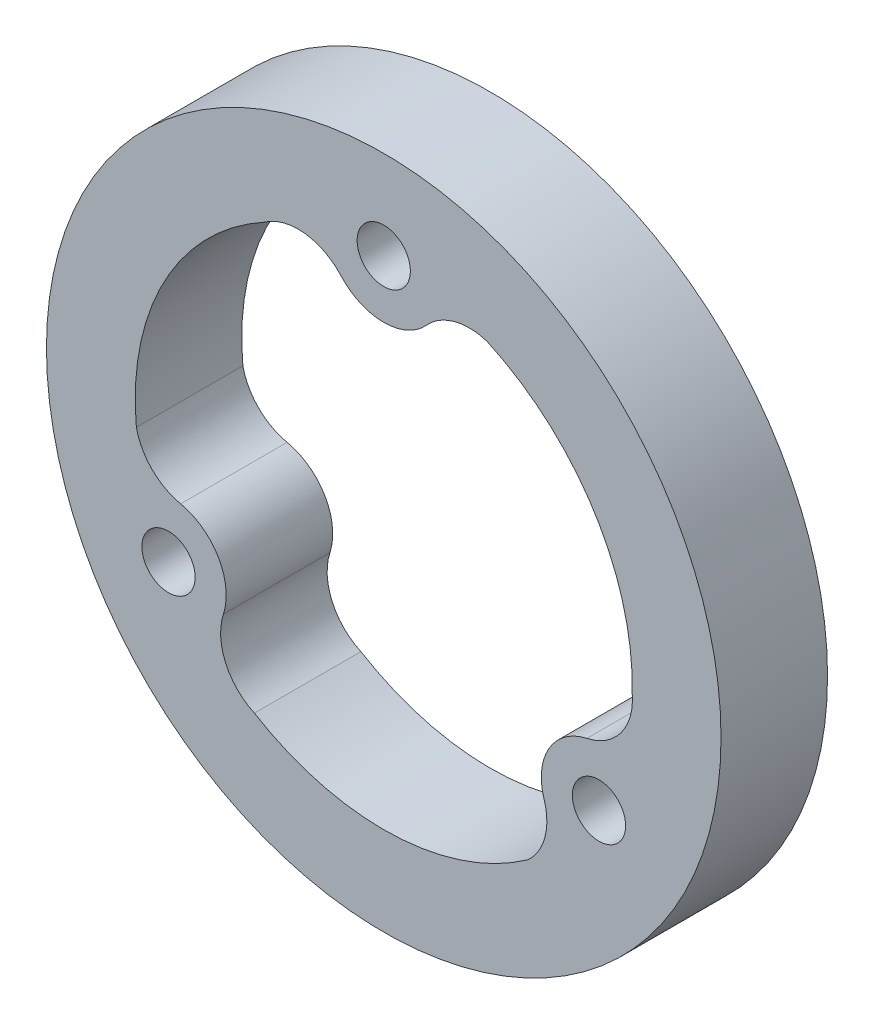
ISO-10303-21;
HEADER;
FILE_DESCRIPTION(('STEP AP214'),'2;1');
FILE_NAME('part.step','',(''),(''),'','','');
FILE_SCHEMA(('AUTOMOTIVE_DESIGN { 1 0 10303 214 1 1 1 1 }'));
ENDSEC;
DATA;
#1=APPLICATION_CONTEXT('core data for automotive mechanical design processes');
#2=APPLICATION_PROTOCOL_DEFINITION('international standard','automotive_design',2000,#1);
#3=PRODUCT_CONTEXT('',#1,'mechanical');
#4=PRODUCT('Part','Part','',(#3));
#5=PRODUCT_RELATED_PRODUCT_CATEGORY('part','',(#4));
#6=PRODUCT_DEFINITION_FORMATION('','',#4);
#7=PRODUCT_DEFINITION_CONTEXT('part definition',#1,'design');
#8=PRODUCT_DEFINITION('design','',#6,#7);
#9=PRODUCT_DEFINITION_SHAPE('','',#8);
#10=(LENGTH_UNIT() NAMED_UNIT(*) SI_UNIT(.MILLI.,.METRE.));
#11=(NAMED_UNIT(*) PLANE_ANGLE_UNIT() SI_UNIT($,.RADIAN.));
#12=(NAMED_UNIT(*) SI_UNIT($,.STERADIAN.) SOLID_ANGLE_UNIT());
#13=UNCERTAINTY_MEASURE_WITH_UNIT(LENGTH_MEASURE(1.E-05),#10,'distance_accuracy_value','');
#14=(GEOMETRIC_REPRESENTATION_CONTEXT(3) GLOBAL_UNCERTAINTY_ASSIGNED_CONTEXT((#13)) GLOBAL_UNIT_ASSIGNED_CONTEXT((#10,
#11,#12)) REPRESENTATION_CONTEXT('',''));
#15=CARTESIAN_POINT('',(0.,0.,0.));
#16=DIRECTION('',(0.,0.,1.));
#17=DIRECTION('',(1.,0.,0.));
#18=AXIS2_PLACEMENT_3D('',#15,#16,#17);
#19=CARTESIAN_POINT('',(0.,0.,6.));
#20=DIRECTION('',(0.,0.,1.));
#21=DIRECTION('',(1.,0.,0.));
#22=AXIS2_PLACEMENT_3D('',#19,#20,#21);
#23=PLANE('',#22);
#24=CARTESIAN_POINT('',(0.,0.,6.));
#25=DIRECTION('',(0.,0.,1.));
#26=DIRECTION('',(1.,0.,0.));
#27=AXIS2_PLACEMENT_3D('',#24,#25,#26);
#28=CIRCLE('',#27,14.);
#29=CARTESIAN_POINT('',(13.9959775932849,-0.335575935174573,6.));
#30=VERTEX_POINT('',#29);
#31=CARTESIAN_POINT('',(5.80943087987062,12.7377593340432,6.));
#32=VERTEX_POINT('',#31);
#33=EDGE_CURVE('E130',#30,#32,#28,.T.);
#34=ORIENTED_EDGE('',*,*,#33,.F.);
#35=CARTESIAN_POINT('',(10.7607074751454,-0.644650784804921,6.));
#36=DIRECTION('',(0.,0.,1.));
#37=DIRECTION('',(1.,0.,0.));
#38=AXIS2_PLACEMENT_3D('',#35,#36,#37);
#39=CIRCLE('',#38,3.25);
#40=CARTESIAN_POINT('',(11.4425315640637,-3.82232539240255,6.));
#41=VERTEX_POINT('',#40);
#42=EDGE_CURVE('E122',#41,#30,#39,.T.);
#43=ORIENTED_EDGE('',*,*,#42,.F.);
#44=CARTESIAN_POINT('',(12.124355652982,-7.00000000000017,6.));
#45=DIRECTION('',(0.,0.,-1.));
#46=DIRECTION('',(1.,0.,0.));
#47=AXIS2_PLACEMENT_3D('',#44,#45,#46);
#48=CIRCLE('',#47,3.25);
#49=CARTESIAN_POINT('',(9.03149667338257,-7.99836032188346,6.));
#50=VERTEX_POINT('',#49);
#51=EDGE_CURVE('E165',#50,#41,#48,.T.);
#52=ORIENTED_EDGE('',*,*,#51,.F.);
#53=CARTESIAN_POINT('',(5.93863769378309,-8.99672064376674,6.));
#54=DIRECTION('',(0.,0.,1.));
#55=DIRECTION('',(1.,0.,0.));
#56=AXIS2_PLACEMENT_3D('',#53,#54,#55);
#57=CIRCLE('',#56,3.25);
#58=CARTESIAN_POINT('',(8.12650773063849,-11.3999943905194,6.));
#59=VERTEX_POINT('',#58);
#60=EDGE_CURVE('E163',#59,#50,#57,.T.);
#61=ORIENTED_EDGE('',*,*,#60,.F.);
#62=CARTESIAN_POINT('',(0.,0.,6.));
#63=DIRECTION('',(0.,0.,1.));
#64=DIRECTION('',(1.,0.,0.));
#65=AXIS2_PLACEMENT_3D('',#62,#63,#64);
#66=CIRCLE('',#65,14.);
#67=CARTESIAN_POINT('',(-7.28860608140232,-11.9530841789952,6.));
#68=VERTEX_POINT('',#67);
#69=EDGE_CURVE('E161',#68,#59,#66,.T.);
#70=ORIENTED_EDGE('',*,*,#69,.F.);
#71=CARTESIAN_POINT('',(-5.93863769378334,-8.99672064376658,6.));
#72=DIRECTION('',(0.,0.,1.));
#73=DIRECTION('',(1.,0.,0.));
#74=AXIS2_PLACEMENT_3D('',#71,#72,#73);
#75=CIRCLE('',#74,3.25);
#76=CARTESIAN_POINT('',(-9.03149667338279,-7.9983603218832,6.));
#77=VERTEX_POINT('',#76);
#78=EDGE_CURVE('E159',#77,#68,#75,.T.);
#79=ORIENTED_EDGE('',*,*,#78,.F.);
#80=CARTESIAN_POINT('',(-12.1243556529822,-6.99999999999983,6.));
#81=DIRECTION('',(0.,0.,-1.));
#82=DIRECTION('',(1.,0.,0.));
#83=AXIS2_PLACEMENT_3D('',#80,#81,#82);
#84=CIRCLE('',#83,3.25);
#85=CARTESIAN_POINT('',(-11.4425315640638,-3.82232539240223,6.));
#86=VERTEX_POINT('',#85);
#87=EDGE_CURVE('E157',#86,#77,#84,.T.);
#88=ORIENTED_EDGE('',*,*,#87,.F.);
#89=CARTESIAN_POINT('',(-10.7607074751454,-0.644650784804622,6.));
#90=DIRECTION('',(0.,0.,1.));
#91=DIRECTION('',(1.,0.,0.));
#92=AXIS2_PLACEMENT_3D('',#89,#90,#91);
#93=CIRCLE('',#92,3.25);
#94=CARTESIAN_POINT('',(-13.9359386105091,-1.33776494352389,6.));
#95=VERTEX_POINT('',#94);
#96=EDGE_CURVE('E155',#95,#86,#93,.T.);
#97=ORIENTED_EDGE('',*,*,#96,.F.);
#98=CARTESIAN_POINT('',(0.,0.,6.));
#99=DIRECTION('',(0.,0.,1.));
#100=DIRECTION('',(1.,0.,0.));
#101=AXIS2_PLACEMENT_3D('',#98,#99,#100);
#102=CIRCLE('',#101,14.);
#103=CARTESIAN_POINT('',(-6.70737151188253,12.2886601141698,6.));
#104=VERTEX_POINT('',#103);
#105=EDGE_CURVE('E153',#104,#95,#102,.T.);
#106=ORIENTED_EDGE('',*,*,#105,.F.);
#107=CARTESIAN_POINT('',(-4.82206978136206,9.6413714285715,6.));
#108=DIRECTION('',(0.,0.,1.));
#109=DIRECTION('',(1.,0.,0.));
#110=AXIS2_PLACEMENT_3D('',#107,#108,#109);
#111=CIRCLE('',#110,3.25);
#112=CARTESIAN_POINT('',(-2.41103489068093,11.8206857142857,6.));
#113=VERTEX_POINT('',#112);
#114=EDGE_CURVE('E151',#113,#104,#111,.T.);
#115=ORIENTED_EDGE('',*,*,#114,.F.);
#116=CARTESIAN_POINT('',(2.01540808952837E-13,14.,6.));
#117=DIRECTION('',(0.,0.,-1.));
#118=DIRECTION('',(1.,0.,0.));
#119=AXIS2_PLACEMENT_3D('',#116,#117,#118);
#120=CIRCLE('',#119,3.25);
#121=CARTESIAN_POINT('',(2.41103489068127,11.8206857142857,6.));
#122=VERTEX_POINT('',#121);
#123=EDGE_CURVE('E146',#122,#113,#120,.T.);
#124=ORIENTED_EDGE('',*,*,#123,.F.);
#125=CARTESIAN_POINT('',(4.82206978136234,9.64137142857136,6.));
#126=DIRECTION('',(0.,0.,1.));
#127=DIRECTION('',(1.,0.,0.));
#128=AXIS2_PLACEMENT_3D('',#125,#126,#127);
#129=CIRCLE('',#128,3.25);
#130=EDGE_CURVE('E144',#32,#122,#129,.T.);
#131=ORIENTED_EDGE('',*,*,#130,.F.);
#132=EDGE_LOOP('',(#34,#43,#52,#61,#70,#79,#88,#97,#106,#115,#124,#131));
#133=FACE_BOUND('',#132,.T.);
#134=CARTESIAN_POINT('',(12.124355652982,-7.00000000000017,6.));
#135=DIRECTION('',(0.,0.,1.));
#136=DIRECTION('',(1.,0.,0.));
#137=AXIS2_PLACEMENT_3D('',#134,#135,#136);
#138=CIRCLE('',#137,1.50000000000007);
#139=CARTESIAN_POINT('',(13.6243556529821,-7.00000000000017,6.));
#140=VERTEX_POINT('',#139);
#141=EDGE_CURVE('E218',#140,#140,#138,.T.);
#142=ORIENTED_EDGE('',*,*,#141,.F.);
#143=EDGE_LOOP('',(#142));
#144=FACE_BOUND('',#143,.T.);
#145=CARTESIAN_POINT('',(0.,0.,6.));
#146=DIRECTION('',(0.,0.,1.));
#147=DIRECTION('',(1.,0.,0.));
#148=AXIS2_PLACEMENT_3D('',#145,#146,#147);
#149=CIRCLE('',#148,19.);
#150=CARTESIAN_POINT('',(19.,0.,6.));
#151=VERTEX_POINT('',#150);
#152=EDGE_CURVE('E11',#151,#151,#149,.T.);
#153=ORIENTED_EDGE('',*,*,#152,.T.);
#154=EDGE_LOOP('',(#153));
#155=FACE_BOUND('',#154,.T.);
#156=CARTESIAN_POINT('',(2.01540808952837E-13,14.,6.));
#157=DIRECTION('',(0.,0.,1.));
#158=DIRECTION('',(1.,0.,0.));
#159=AXIS2_PLACEMENT_3D('',#156,#157,#158);
#160=CIRCLE('',#159,1.5);
#161=CARTESIAN_POINT('',(1.5000000000002,14.,6.));
#162=VERTEX_POINT('',#161);
#163=EDGE_CURVE('E224',#162,#162,#160,.T.);
#164=ORIENTED_EDGE('',*,*,#163,.F.);
#165=EDGE_LOOP('',(#164));
#166=FACE_BOUND('',#165,.T.);
#167=CARTESIAN_POINT('',(-12.1243556529822,-6.99999999999983,6.));
#168=DIRECTION('',(0.,0.,1.));
#169=DIRECTION('',(1.,0.,0.));
#170=AXIS2_PLACEMENT_3D('',#167,#168,#169);
#171=CIRCLE('',#170,1.5);
#172=CARTESIAN_POINT('',(-10.6243556529822,-6.99999999999983,6.));
#173=VERTEX_POINT('',#172);
#174=EDGE_CURVE('E168',#173,#173,#171,.T.);
#175=ORIENTED_EDGE('',*,*,#174,.F.);
#176=EDGE_LOOP('',(#175));
#177=FACE_BOUND('',#176,.T.);
#178=ADVANCED_FACE('F33',(#133,#144,#155,#166,#177),#23,.T.);
#179=CARTESIAN_POINT('',(0.,0.,0.));
#180=DIRECTION('',(0.,0.,1.));
#181=DIRECTION('',(1.,0.,0.));
#182=AXIS2_PLACEMENT_3D('',#179,#180,#181);
#183=PLANE('',#182);
#184=CARTESIAN_POINT('',(12.124355652982,-7.00000000000017,0.));
#185=DIRECTION('',(0.,0.,1.));
#186=DIRECTION('',(1.,0.,0.));
#187=AXIS2_PLACEMENT_3D('',#184,#185,#186);
#188=CIRCLE('',#187,1.50000000000007);
#189=CARTESIAN_POINT('',(13.6243556529821,-7.00000000000017,0.));
#190=VERTEX_POINT('',#189);
#191=EDGE_CURVE('E138',#190,#190,#188,.T.);
#192=ORIENTED_EDGE('',*,*,#191,.T.);
#193=EDGE_LOOP('',(#192));
#194=FACE_BOUND('',#193,.T.);
#195=CARTESIAN_POINT('',(2.01540808952837E-13,14.,0.));
#196=DIRECTION('',(0.,0.,1.));
#197=DIRECTION('',(1.,0.,0.));
#198=AXIS2_PLACEMENT_3D('',#195,#196,#197);
#199=CIRCLE('',#198,1.5);
#200=CARTESIAN_POINT('',(1.5000000000002,14.,0.));
#201=VERTEX_POINT('',#200);
#202=EDGE_CURVE('E221',#201,#201,#199,.T.);
#203=ORIENTED_EDGE('',*,*,#202,.T.);
#204=EDGE_LOOP('',(#203));
#205=FACE_BOUND('',#204,.T.);
#206=CARTESIAN_POINT('',(0.,0.,0.));
#207=DIRECTION('',(0.,0.,1.));
#208=DIRECTION('',(1.,0.,0.));
#209=AXIS2_PLACEMENT_3D('',#206,#207,#208);
#210=CIRCLE('',#209,19.);
#211=CARTESIAN_POINT('',(19.,0.,0.));
#212=VERTEX_POINT('',#211);
#213=EDGE_CURVE('E37',#212,#212,#210,.T.);
#214=ORIENTED_EDGE('',*,*,#213,.F.);
#215=EDGE_LOOP('',(#214));
#216=FACE_BOUND('',#215,.T.);
#217=CARTESIAN_POINT('',(10.7607074751454,-0.644650784804921,0.));
#218=DIRECTION('',(0.,0.,1.));
#219=DIRECTION('',(1.,0.,0.));
#220=AXIS2_PLACEMENT_3D('',#217,#218,#219);
#221=CIRCLE('',#220,3.25);
#222=CARTESIAN_POINT('',(11.4425315640637,-3.82232539240255,0.));
#223=VERTEX_POINT('',#222);
#224=CARTESIAN_POINT('',(13.9959775932849,-0.335575935174573,0.));
#225=VERTEX_POINT('',#224);
#226=EDGE_CURVE('E56',#223,#225,#221,.T.);
#227=ORIENTED_EDGE('',*,*,#226,.T.);
#228=CARTESIAN_POINT('',(0.,0.,0.));
#229=DIRECTION('',(0.,0.,1.));
#230=DIRECTION('',(1.,0.,0.));
#231=AXIS2_PLACEMENT_3D('',#228,#229,#230);
#232=CIRCLE('',#231,14.);
#233=CARTESIAN_POINT('',(5.80943087987062,12.7377593340432,0.));
#234=VERTEX_POINT('',#233);
#235=EDGE_CURVE('E137',#225,#234,#232,.T.);
#236=ORIENTED_EDGE('',*,*,#235,.T.);
#237=CARTESIAN_POINT('',(4.82206978136234,9.64137142857136,0.));
#238=DIRECTION('',(0.,0.,1.));
#239=DIRECTION('',(1.,0.,0.));
#240=AXIS2_PLACEMENT_3D('',#237,#238,#239);
#241=CIRCLE('',#240,3.25);
#242=CARTESIAN_POINT('',(2.41103489068127,11.8206857142857,0.));
#243=VERTEX_POINT('',#242);
#244=EDGE_CURVE('E170',#234,#243,#241,.T.);
#245=ORIENTED_EDGE('',*,*,#244,.T.);
#246=CARTESIAN_POINT('',(2.01540808952837E-13,14.,0.));
#247=DIRECTION('',(0.,0.,-1.));
#248=DIRECTION('',(1.,0.,0.));
#249=AXIS2_PLACEMENT_3D('',#246,#247,#248);
#250=CIRCLE('',#249,3.25);
#251=CARTESIAN_POINT('',(-2.41103489068093,11.8206857142857,0.));
#252=VERTEX_POINT('',#251);
#253=EDGE_CURVE('E173',#243,#252,#250,.T.);
#254=ORIENTED_EDGE('',*,*,#253,.T.);
#255=CARTESIAN_POINT('',(-4.82206978136206,9.6413714285715,0.));
#256=DIRECTION('',(0.,0.,1.));
#257=DIRECTION('',(1.,0.,0.));
#258=AXIS2_PLACEMENT_3D('',#255,#256,#257);
#259=CIRCLE('',#258,3.25);
#260=CARTESIAN_POINT('',(-6.70737151188253,12.2886601141698,0.));
#261=VERTEX_POINT('',#260);
#262=EDGE_CURVE('E176',#252,#261,#259,.T.);
#263=ORIENTED_EDGE('',*,*,#262,.T.);
#264=CARTESIAN_POINT('',(0.,0.,0.));
#265=DIRECTION('',(0.,0.,1.));
#266=DIRECTION('',(1.,0.,0.));
#267=AXIS2_PLACEMENT_3D('',#264,#265,#266);
#268=CIRCLE('',#267,14.);
#269=CARTESIAN_POINT('',(-13.9359386105091,-1.33776494352389,0.));
#270=VERTEX_POINT('',#269);
#271=EDGE_CURVE('E179',#261,#270,#268,.T.);
#272=ORIENTED_EDGE('',*,*,#271,.T.);
#273=CARTESIAN_POINT('',(-10.7607074751454,-0.644650784804622,0.));
#274=DIRECTION('',(0.,0.,1.));
#275=DIRECTION('',(1.,0.,0.));
#276=AXIS2_PLACEMENT_3D('',#273,#274,#275);
#277=CIRCLE('',#276,3.25);
#278=CARTESIAN_POINT('',(-11.4425315640638,-3.82232539240223,0.));
#279=VERTEX_POINT('',#278);
#280=EDGE_CURVE('E182',#270,#279,#277,.T.);
#281=ORIENTED_EDGE('',*,*,#280,.T.);
#282=CARTESIAN_POINT('',(-12.1243556529822,-6.99999999999983,0.));
#283=DIRECTION('',(0.,0.,-1.));
#284=DIRECTION('',(1.,0.,0.));
#285=AXIS2_PLACEMENT_3D('',#282,#283,#284);
#286=CIRCLE('',#285,3.25);
#287=CARTESIAN_POINT('',(-9.03149667338279,-7.9983603218832,0.));
#288=VERTEX_POINT('',#287);
#289=EDGE_CURVE('E185',#279,#288,#286,.T.);
#290=ORIENTED_EDGE('',*,*,#289,.T.);
#291=CARTESIAN_POINT('',(-5.93863769378334,-8.99672064376658,0.));
#292=DIRECTION('',(0.,0.,1.));
#293=DIRECTION('',(1.,0.,0.));
#294=AXIS2_PLACEMENT_3D('',#291,#292,#293);
#295=CIRCLE('',#294,3.25);
#296=CARTESIAN_POINT('',(-7.28860608140232,-11.9530841789952,0.));
#297=VERTEX_POINT('',#296);
#298=EDGE_CURVE('E188',#288,#297,#295,.T.);
#299=ORIENTED_EDGE('',*,*,#298,.T.);
#300=CARTESIAN_POINT('',(0.,0.,0.));
#301=DIRECTION('',(0.,0.,1.));
#302=DIRECTION('',(1.,0.,0.));
#303=AXIS2_PLACEMENT_3D('',#300,#301,#302);
#304=CIRCLE('',#303,14.);
#305=CARTESIAN_POINT('',(8.12650773063849,-11.3999943905194,0.));
#306=VERTEX_POINT('',#305);
#307=EDGE_CURVE('E191',#297,#306,#304,.T.);
#308=ORIENTED_EDGE('',*,*,#307,.T.);
#309=CARTESIAN_POINT('',(5.93863769378309,-8.99672064376674,0.));
#310=DIRECTION('',(0.,0.,1.));
#311=DIRECTION('',(1.,0.,0.));
#312=AXIS2_PLACEMENT_3D('',#309,#310,#311);
#313=CIRCLE('',#312,3.25);
#314=CARTESIAN_POINT('',(9.03149667338257,-7.99836032188346,0.));
#315=VERTEX_POINT('',#314);
#316=EDGE_CURVE('E194',#306,#315,#313,.T.);
#317=ORIENTED_EDGE('',*,*,#316,.T.);
#318=CARTESIAN_POINT('',(12.124355652982,-7.00000000000017,0.));
#319=DIRECTION('',(0.,0.,-1.));
#320=DIRECTION('',(1.,0.,0.));
#321=AXIS2_PLACEMENT_3D('',#318,#319,#320);
#322=CIRCLE('',#321,3.25);
#323=EDGE_CURVE('E131',#315,#223,#322,.T.);
#324=ORIENTED_EDGE('',*,*,#323,.T.);
#325=EDGE_LOOP('',(#227,#236,#245,#254,#263,#272,#281,#290,#299,#308,#317,#324));
#326=FACE_BOUND('',#325,.T.);
#327=CARTESIAN_POINT('',(-12.1243556529822,-6.99999999999983,0.));
#328=DIRECTION('',(0.,0.,1.));
#329=DIRECTION('',(1.,0.,0.));
#330=AXIS2_PLACEMENT_3D('',#327,#328,#329);
#331=CIRCLE('',#330,1.5);
#332=CARTESIAN_POINT('',(-10.6243556529822,-6.99999999999983,0.));
#333=VERTEX_POINT('',#332);
#334=EDGE_CURVE('E403',#333,#333,#331,.T.);
#335=ORIENTED_EDGE('',*,*,#334,.T.);
#336=EDGE_LOOP('',(#335));
#337=FACE_BOUND('',#336,.T.);
#338=ADVANCED_FACE('F230',(#194,#205,#216,#326,#337),#183,.F.);
#339=CARTESIAN_POINT('',(0.,0.,6.));
#340=DIRECTION('',(0.,0.,-1.));
#341=DIRECTION('',(-1.,0.,0.));
#342=AXIS2_PLACEMENT_3D('',#339,#340,#341);
#343=CYLINDRICAL_SURFACE('',#342,19.);
#344=ORIENTED_EDGE('',*,*,#152,.F.);
#345=EDGE_LOOP('',(#344));
#346=FACE_BOUND('',#345,.T.);
#347=ORIENTED_EDGE('',*,*,#213,.T.);
#348=EDGE_LOOP('',(#347));
#349=FACE_BOUND('',#348,.T.);
#350=ADVANCED_FACE('F35',(#346,#349),#343,.T.);
#351=CARTESIAN_POINT('',(2.01540808952837E-13,14.,6.));
#352=DIRECTION('',(0.,0.,-1.));
#353=DIRECTION('',(-1.,0.,0.));
#354=AXIS2_PLACEMENT_3D('',#351,#352,#353);
#355=CYLINDRICAL_SURFACE('',#354,1.5);
#356=ORIENTED_EDGE('',*,*,#163,.T.);
#357=EDGE_LOOP('',(#356));
#358=FACE_BOUND('',#357,.T.);
#359=ORIENTED_EDGE('',*,*,#202,.F.);
#360=EDGE_LOOP('',(#359));
#361=FACE_BOUND('',#360,.T.);
#362=ADVANCED_FACE('F233',(#358,#361),#355,.F.);
#363=CARTESIAN_POINT('',(12.124355652982,-7.00000000000017,6.));
#364=DIRECTION('',(0.,0.,-1.));
#365=DIRECTION('',(-1.,0.,0.));
#366=AXIS2_PLACEMENT_3D('',#363,#364,#365);
#367=CYLINDRICAL_SURFACE('',#366,1.50000000000007);
#368=ORIENTED_EDGE('',*,*,#141,.T.);
#369=EDGE_LOOP('',(#368));
#370=FACE_BOUND('',#369,.T.);
#371=ORIENTED_EDGE('',*,*,#191,.F.);
#372=EDGE_LOOP('',(#371));
#373=FACE_BOUND('',#372,.T.);
#374=ADVANCED_FACE('F235',(#370,#373),#367,.F.);
#375=CARTESIAN_POINT('',(10.7607074751454,-0.644650784804921,6.));
#376=DIRECTION('',(0.,0.,-1.));
#377=DIRECTION('',(-1.,0.,0.));
#378=AXIS2_PLACEMENT_3D('',#375,#376,#377);
#379=CYLINDRICAL_SURFACE('',#378,3.25);
#380=ORIENTED_EDGE('',*,*,#226,.F.);
#381=DIRECTION('',(0.,0.,-1.));
#382=VECTOR('',#381,1.);
#383=CARTESIAN_POINT('',(11.4425315640637,-3.82232539240255,6.));
#384=LINE('',#383,#382);
#385=EDGE_CURVE('E126',#41,#223,#384,.T.);
#386=ORIENTED_EDGE('',*,*,#385,.F.);
#387=ORIENTED_EDGE('',*,*,#42,.T.);
#388=DIRECTION('',(0.,0.,-1.));
#389=VECTOR('',#388,1.);
#390=CARTESIAN_POINT('',(13.9959775932849,-0.335575935174573,6.));
#391=LINE('',#390,#389);
#392=EDGE_CURVE('E125',#30,#225,#391,.T.);
#393=ORIENTED_EDGE('',*,*,#392,.T.);
#394=EDGE_LOOP('',(#380,#386,#387,#393));
#395=FACE_BOUND('',#394,.T.);
#396=ADVANCED_FACE('F124',(#395),#379,.F.);
#397=CARTESIAN_POINT('',(0.,0.,6.));
#398=DIRECTION('',(0.,0.,-1.));
#399=DIRECTION('',(-1.,0.,0.));
#400=AXIS2_PLACEMENT_3D('',#397,#398,#399);
#401=CYLINDRICAL_SURFACE('',#400,14.);
#402=ORIENTED_EDGE('',*,*,#235,.F.);
#403=ORIENTED_EDGE('',*,*,#392,.F.);
#404=ORIENTED_EDGE('',*,*,#33,.T.);
#405=DIRECTION('',(0.,0.,-1.));
#406=VECTOR('',#405,1.);
#407=CARTESIAN_POINT('',(5.80943087987062,12.7377593340432,6.));
#408=LINE('',#407,#406);
#409=EDGE_CURVE('E139',#32,#234,#408,.T.);
#410=ORIENTED_EDGE('',*,*,#409,.T.);
#411=EDGE_LOOP('',(#402,#403,#404,#410));
#412=FACE_BOUND('',#411,.T.);
#413=ADVANCED_FACE('F134',(#412),#401,.F.);
#414=CARTESIAN_POINT('',(4.82206978136234,9.64137142857136,6.));
#415=DIRECTION('',(0.,0.,-1.));
#416=DIRECTION('',(-1.,0.,0.));
#417=AXIS2_PLACEMENT_3D('',#414,#415,#416);
#418=CYLINDRICAL_SURFACE('',#417,3.25);
#419=ORIENTED_EDGE('',*,*,#244,.F.);
#420=ORIENTED_EDGE('',*,*,#409,.F.);
#421=ORIENTED_EDGE('',*,*,#130,.T.);
#422=DIRECTION('',(0.,0.,-1.));
#423=VECTOR('',#422,1.);
#424=CARTESIAN_POINT('',(2.41103489068127,11.8206857142857,6.));
#425=LINE('',#424,#423);
#426=EDGE_CURVE('E215',#122,#243,#425,.T.);
#427=ORIENTED_EDGE('',*,*,#426,.T.);
#428=EDGE_LOOP('',(#419,#420,#421,#427));
#429=FACE_BOUND('',#428,.T.);
#430=ADVANCED_FACE('F286',(#429),#418,.F.);
#431=CARTESIAN_POINT('',(2.01540808952837E-13,14.,6.));
#432=DIRECTION('',(0.,0.,-1.));
#433=DIRECTION('',(-1.,0.,0.));
#434=AXIS2_PLACEMENT_3D('',#431,#432,#433);
#435=CYLINDRICAL_SURFACE('',#434,3.25);
#436=ORIENTED_EDGE('',*,*,#253,.F.);
#437=ORIENTED_EDGE('',*,*,#426,.F.);
#438=ORIENTED_EDGE('',*,*,#123,.T.);
#439=DIRECTION('',(0.,0.,-1.));
#440=VECTOR('',#439,1.);
#441=CARTESIAN_POINT('',(-2.41103489068093,11.8206857142857,6.));
#442=LINE('',#441,#440);
#443=EDGE_CURVE('E213',#113,#252,#442,.T.);
#444=ORIENTED_EDGE('',*,*,#443,.T.);
#445=EDGE_LOOP('',(#436,#437,#438,#444));
#446=FACE_BOUND('',#445,.T.);
#447=ADVANCED_FACE('F295',(#446),#435,.T.);
#448=CARTESIAN_POINT('',(-4.82206978136206,9.6413714285715,6.));
#449=DIRECTION('',(0.,0.,-1.));
#450=DIRECTION('',(-1.,0.,0.));
#451=AXIS2_PLACEMENT_3D('',#448,#449,#450);
#452=CYLINDRICAL_SURFACE('',#451,3.25);
#453=ORIENTED_EDGE('',*,*,#262,.F.);
#454=ORIENTED_EDGE('',*,*,#443,.F.);
#455=ORIENTED_EDGE('',*,*,#114,.T.);
#456=DIRECTION('',(0.,0.,-1.));
#457=VECTOR('',#456,1.);
#458=CARTESIAN_POINT('',(-6.70737151188253,12.2886601141698,6.));
#459=LINE('',#458,#457);
#460=EDGE_CURVE('E211',#104,#261,#459,.T.);
#461=ORIENTED_EDGE('',*,*,#460,.T.);
#462=EDGE_LOOP('',(#453,#454,#455,#461));
#463=FACE_BOUND('',#462,.T.);
#464=ADVANCED_FACE('F305',(#463),#452,.F.);
#465=CARTESIAN_POINT('',(0.,0.,6.));
#466=DIRECTION('',(0.,0.,-1.));
#467=DIRECTION('',(-1.,0.,0.));
#468=AXIS2_PLACEMENT_3D('',#465,#466,#467);
#469=CYLINDRICAL_SURFACE('',#468,14.);
#470=ORIENTED_EDGE('',*,*,#271,.F.);
#471=ORIENTED_EDGE('',*,*,#460,.F.);
#472=ORIENTED_EDGE('',*,*,#105,.T.);
#473=DIRECTION('',(0.,0.,-1.));
#474=VECTOR('',#473,1.);
#475=CARTESIAN_POINT('',(-13.9359386105091,-1.33776494352389,6.));
#476=LINE('',#475,#474);
#477=EDGE_CURVE('E209',#95,#270,#476,.T.);
#478=ORIENTED_EDGE('',*,*,#477,.T.);
#479=EDGE_LOOP('',(#470,#471,#472,#478));
#480=FACE_BOUND('',#479,.T.);
#481=ADVANCED_FACE('F315',(#480),#469,.F.);
#482=CARTESIAN_POINT('',(-10.7607074751454,-0.644650784804622,6.));
#483=DIRECTION('',(0.,0.,-1.));
#484=DIRECTION('',(-1.,0.,0.));
#485=AXIS2_PLACEMENT_3D('',#482,#483,#484);
#486=CYLINDRICAL_SURFACE('',#485,3.25);
#487=ORIENTED_EDGE('',*,*,#280,.F.);
#488=ORIENTED_EDGE('',*,*,#477,.F.);
#489=ORIENTED_EDGE('',*,*,#96,.T.);
#490=DIRECTION('',(0.,0.,-1.));
#491=VECTOR('',#490,1.);
#492=CARTESIAN_POINT('',(-11.4425315640638,-3.82232539240223,6.));
#493=LINE('',#492,#491);
#494=EDGE_CURVE('E207',#86,#279,#493,.T.);
#495=ORIENTED_EDGE('',*,*,#494,.T.);
#496=EDGE_LOOP('',(#487,#488,#489,#495));
#497=FACE_BOUND('',#496,.T.);
#498=ADVANCED_FACE('F325',(#497),#486,.F.);
#499=CARTESIAN_POINT('',(-12.1243556529822,-6.99999999999983,6.));
#500=DIRECTION('',(0.,0.,-1.));
#501=DIRECTION('',(-1.,0.,0.));
#502=AXIS2_PLACEMENT_3D('',#499,#500,#501);
#503=CYLINDRICAL_SURFACE('',#502,3.25);
#504=ORIENTED_EDGE('',*,*,#289,.F.);
#505=ORIENTED_EDGE('',*,*,#494,.F.);
#506=ORIENTED_EDGE('',*,*,#87,.T.);
#507=DIRECTION('',(0.,0.,-1.));
#508=VECTOR('',#507,1.);
#509=CARTESIAN_POINT('',(-9.03149667338279,-7.9983603218832,6.));
#510=LINE('',#509,#508);
#511=EDGE_CURVE('E205',#77,#288,#510,.T.);
#512=ORIENTED_EDGE('',*,*,#511,.T.);
#513=EDGE_LOOP('',(#504,#505,#506,#512));
#514=FACE_BOUND('',#513,.T.);
#515=ADVANCED_FACE('F335',(#514),#503,.T.);
#516=CARTESIAN_POINT('',(-5.93863769378334,-8.99672064376658,6.));
#517=DIRECTION('',(0.,0.,-1.));
#518=DIRECTION('',(-1.,0.,0.));
#519=AXIS2_PLACEMENT_3D('',#516,#517,#518);
#520=CYLINDRICAL_SURFACE('',#519,3.25);
#521=ORIENTED_EDGE('',*,*,#298,.F.);
#522=ORIENTED_EDGE('',*,*,#511,.F.);
#523=ORIENTED_EDGE('',*,*,#78,.T.);
#524=DIRECTION('',(0.,0.,-1.));
#525=VECTOR('',#524,1.);
#526=CARTESIAN_POINT('',(-7.28860608140232,-11.9530841789952,6.));
#527=LINE('',#526,#525);
#528=EDGE_CURVE('E203',#68,#297,#527,.T.);
#529=ORIENTED_EDGE('',*,*,#528,.T.);
#530=EDGE_LOOP('',(#521,#522,#523,#529));
#531=FACE_BOUND('',#530,.T.);
#532=ADVANCED_FACE('F345',(#531),#520,.F.);
#533=CARTESIAN_POINT('',(0.,0.,6.));
#534=DIRECTION('',(0.,0.,-1.));
#535=DIRECTION('',(-1.,0.,0.));
#536=AXIS2_PLACEMENT_3D('',#533,#534,#535);
#537=CYLINDRICAL_SURFACE('',#536,14.);
#538=ORIENTED_EDGE('',*,*,#307,.F.);
#539=ORIENTED_EDGE('',*,*,#528,.F.);
#540=ORIENTED_EDGE('',*,*,#69,.T.);
#541=DIRECTION('',(0.,0.,-1.));
#542=VECTOR('',#541,1.);
#543=CARTESIAN_POINT('',(8.12650773063849,-11.3999943905194,6.));
#544=LINE('',#543,#542);
#545=EDGE_CURVE('E201',#59,#306,#544,.T.);
#546=ORIENTED_EDGE('',*,*,#545,.T.);
#547=EDGE_LOOP('',(#538,#539,#540,#546));
#548=FACE_BOUND('',#547,.T.);
#549=ADVANCED_FACE('F355',(#548),#537,.F.);
#550=CARTESIAN_POINT('',(5.93863769378309,-8.99672064376674,6.));
#551=DIRECTION('',(0.,0.,-1.));
#552=DIRECTION('',(-1.,0.,0.));
#553=AXIS2_PLACEMENT_3D('',#550,#551,#552);
#554=CYLINDRICAL_SURFACE('',#553,3.25);
#555=ORIENTED_EDGE('',*,*,#316,.F.);
#556=ORIENTED_EDGE('',*,*,#545,.F.);
#557=ORIENTED_EDGE('',*,*,#60,.T.);
#558=DIRECTION('',(0.,0.,-1.));
#559=VECTOR('',#558,1.);
#560=CARTESIAN_POINT('',(9.03149667338257,-7.99836032188346,6.));
#561=LINE('',#560,#559);
#562=EDGE_CURVE('E48',#50,#315,#561,.T.);
#563=ORIENTED_EDGE('',*,*,#562,.T.);
#564=EDGE_LOOP('',(#555,#556,#557,#563));
#565=FACE_BOUND('',#564,.T.);
#566=ADVANCED_FACE('F365',(#565),#554,.F.);
#567=CARTESIAN_POINT('',(12.124355652982,-7.00000000000017,6.));
#568=DIRECTION('',(0.,0.,-1.));
#569=DIRECTION('',(-1.,0.,0.));
#570=AXIS2_PLACEMENT_3D('',#567,#568,#569);
#571=CYLINDRICAL_SURFACE('',#570,3.25);
#572=ORIENTED_EDGE('',*,*,#323,.F.);
#573=ORIENTED_EDGE('',*,*,#562,.F.);
#574=ORIENTED_EDGE('',*,*,#51,.T.);
#575=ORIENTED_EDGE('',*,*,#385,.T.);
#576=EDGE_LOOP('',(#572,#573,#574,#575));
#577=FACE_BOUND('',#576,.T.);
#578=ADVANCED_FACE('F375',(#577),#571,.T.);
#579=CARTESIAN_POINT('',(-12.1243556529822,-6.99999999999983,6.));
#580=DIRECTION('',(0.,0.,-1.));
#581=DIRECTION('',(-1.,0.,0.));
#582=AXIS2_PLACEMENT_3D('',#579,#580,#581);
#583=CYLINDRICAL_SURFACE('',#582,1.5);
#584=ORIENTED_EDGE('',*,*,#174,.T.);
#585=EDGE_LOOP('',(#584));
#586=FACE_BOUND('',#585,.T.);
#587=ORIENTED_EDGE('',*,*,#334,.F.);
#588=EDGE_LOOP('',(#587));
#589=FACE_BOUND('',#588,.T.);
#590=ADVANCED_FACE('F385',(#586,#589),#583,.F.);
#591=CLOSED_SHELL('',(#178,#338,#350,#362,#374,#396,#413,#430,#447,#464,#481,#498,#515,#532,
#549,#566,#578,#590));
#592=MANIFOLD_SOLID_BREP('B2',#591);
#593=ADVANCED_BREP_SHAPE_REPRESENTATION('',(#18,#592),#14);
#594=SHAPE_DEFINITION_REPRESENTATION(#9,#593);
ENDSEC;
END-ISO-10303-21;
